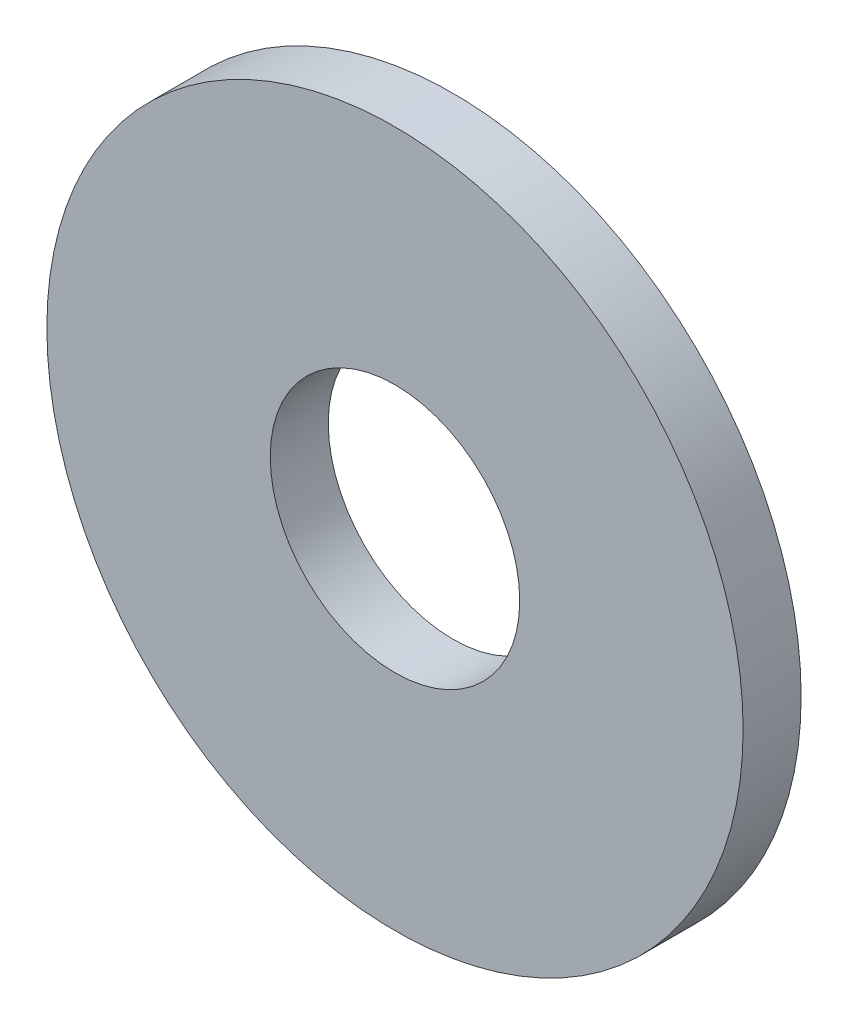
ISO-10303-21;
HEADER;
FILE_DESCRIPTION(('STEP AP214'),'2;1');
FILE_NAME('part.step','',(''),(''),'','','');
FILE_SCHEMA(('AUTOMOTIVE_DESIGN { 1 0 10303 214 1 1 1 1 }'));
ENDSEC;
DATA;
#1=APPLICATION_CONTEXT('core data for automotive mechanical design processes');
#2=APPLICATION_PROTOCOL_DEFINITION('international standard','automotive_design',2000,#1);
#3=PRODUCT_CONTEXT('',#1,'mechanical');
#4=PRODUCT('Part','Part','',(#3));
#5=PRODUCT_RELATED_PRODUCT_CATEGORY('part','',(#4));
#6=PRODUCT_DEFINITION_FORMATION('','',#4);
#7=PRODUCT_DEFINITION_CONTEXT('part definition',#1,'design');
#8=PRODUCT_DEFINITION('design','',#6,#7);
#9=PRODUCT_DEFINITION_SHAPE('','',#8);
#10=(LENGTH_UNIT() NAMED_UNIT(*) SI_UNIT(.MILLI.,.METRE.));
#11=(NAMED_UNIT(*) PLANE_ANGLE_UNIT() SI_UNIT($,.RADIAN.));
#12=(NAMED_UNIT(*) SI_UNIT($,.STERADIAN.) SOLID_ANGLE_UNIT());
#13=UNCERTAINTY_MEASURE_WITH_UNIT(LENGTH_MEASURE(1.E-05),#10,'distance_accuracy_value','');
#14=(GEOMETRIC_REPRESENTATION_CONTEXT(3) GLOBAL_UNCERTAINTY_ASSIGNED_CONTEXT((#13)) GLOBAL_UNIT_ASSIGNED_CONTEXT((#10,
#11,#12)) REPRESENTATION_CONTEXT('',''));
#15=CARTESIAN_POINT('',(0.,0.,0.));
#16=DIRECTION('',(0.,0.,1.));
#17=DIRECTION('',(1.,0.,0.));
#18=AXIS2_PLACEMENT_3D('',#15,#16,#17);
#19=CARTESIAN_POINT('',(0.,0.,-1.));
#20=DIRECTION('',(0.,0.,1.));
#21=DIRECTION('',(1.,0.,0.));
#22=AXIS2_PLACEMENT_3D('',#19,#20,#21);
#23=CYLINDRICAL_SURFACE('',#22,6.);
#24=CARTESIAN_POINT('',(0.,0.,-1.));
#25=DIRECTION('',(0.,0.,1.));
#26=DIRECTION('',(1.,0.,0.));
#27=AXIS2_PLACEMENT_3D('',#24,#25,#26);
#28=CIRCLE('',#27,6.);
#29=CARTESIAN_POINT('',(6.,0.,-1.));
#30=VERTEX_POINT('',#29);
#31=EDGE_CURVE('E10',#30,#30,#28,.T.);
#32=ORIENTED_EDGE('',*,*,#31,.T.);
#33=EDGE_LOOP('',(#32));
#34=FACE_BOUND('',#33,.T.);
#35=CARTESIAN_POINT('',(0.,0.,0.));
#36=DIRECTION('',(0.,0.,1.));
#37=DIRECTION('',(1.,0.,0.));
#38=AXIS2_PLACEMENT_3D('',#35,#36,#37);
#39=CIRCLE('',#38,6.);
#40=CARTESIAN_POINT('',(6.,0.,0.));
#41=VERTEX_POINT('',#40);
#42=EDGE_CURVE('E34',#41,#41,#39,.T.);
#43=ORIENTED_EDGE('',*,*,#42,.F.);
#44=EDGE_LOOP('',(#43));
#45=FACE_BOUND('',#44,.T.);
#46=ADVANCED_FACE('F31',(#34,#45),#23,.T.);
#47=CARTESIAN_POINT('',(0.,0.,-1.));
#48=DIRECTION('',(0.,0.,1.));
#49=DIRECTION('',(1.,0.,0.));
#50=AXIS2_PLACEMENT_3D('',#47,#48,#49);
#51=PLANE('',#50);
#52=CARTESIAN_POINT('',(0.,0.,-1.));
#53=DIRECTION('',(0.,0.,1.));
#54=DIRECTION('',(1.,0.,0.));
#55=AXIS2_PLACEMENT_3D('',#52,#53,#54);
#56=CIRCLE('',#55,2.15);
#57=CARTESIAN_POINT('',(2.15,0.,-1.));
#58=VERTEX_POINT('',#57);
#59=EDGE_CURVE('E41',#58,#58,#56,.T.);
#60=ORIENTED_EDGE('',*,*,#59,.T.);
#61=EDGE_LOOP('',(#60));
#62=FACE_BOUND('',#61,.T.);
#63=ORIENTED_EDGE('',*,*,#31,.F.);
#64=EDGE_LOOP('',(#63));
#65=FACE_BOUND('',#64,.T.);
#66=ADVANCED_FACE('F49',(#62,#65),#51,.F.);
#67=CARTESIAN_POINT('',(0.,0.,0.));
#68=DIRECTION('',(0.,0.,1.));
#69=DIRECTION('',(1.,0.,0.));
#70=AXIS2_PLACEMENT_3D('',#67,#68,#69);
#71=PLANE('',#70);
#72=CARTESIAN_POINT('',(0.,0.,0.));
#73=DIRECTION('',(0.,0.,1.));
#74=DIRECTION('',(1.,0.,0.));
#75=AXIS2_PLACEMENT_3D('',#72,#73,#74);
#76=CIRCLE('',#75,2.15);
#77=CARTESIAN_POINT('',(2.15,0.,0.));
#78=VERTEX_POINT('',#77);
#79=EDGE_CURVE('E43',#78,#78,#76,.T.);
#80=ORIENTED_EDGE('',*,*,#79,.F.);
#81=EDGE_LOOP('',(#80));
#82=FACE_BOUND('',#81,.T.);
#83=ORIENTED_EDGE('',*,*,#42,.T.);
#84=EDGE_LOOP('',(#83));
#85=FACE_BOUND('',#84,.T.);
#86=ADVANCED_FACE('F55',(#82,#85),#71,.T.);
#87=CARTESIAN_POINT('',(0.,0.,-1.));
#88=DIRECTION('',(0.,0.,1.));
#89=DIRECTION('',(1.,0.,0.));
#90=AXIS2_PLACEMENT_3D('',#87,#88,#89);
#91=CYLINDRICAL_SURFACE('',#90,2.15);
#92=ORIENTED_EDGE('',*,*,#59,.F.);
#93=EDGE_LOOP('',(#92));
#94=FACE_BOUND('',#93,.T.);
#95=ORIENTED_EDGE('',*,*,#79,.T.);
#96=EDGE_LOOP('',(#95));
#97=FACE_BOUND('',#96,.T.);
#98=ADVANCED_FACE('F52',(#94,#97),#91,.F.);
#99=CLOSED_SHELL('',(#46,#66,#86,#98));
#100=MANIFOLD_SOLID_BREP('B2',#99);
#101=ADVANCED_BREP_SHAPE_REPRESENTATION('',(#18,#100),#14);
#102=SHAPE_DEFINITION_REPRESENTATION(#9,#101);
ENDSEC;
END-ISO-10303-21;
